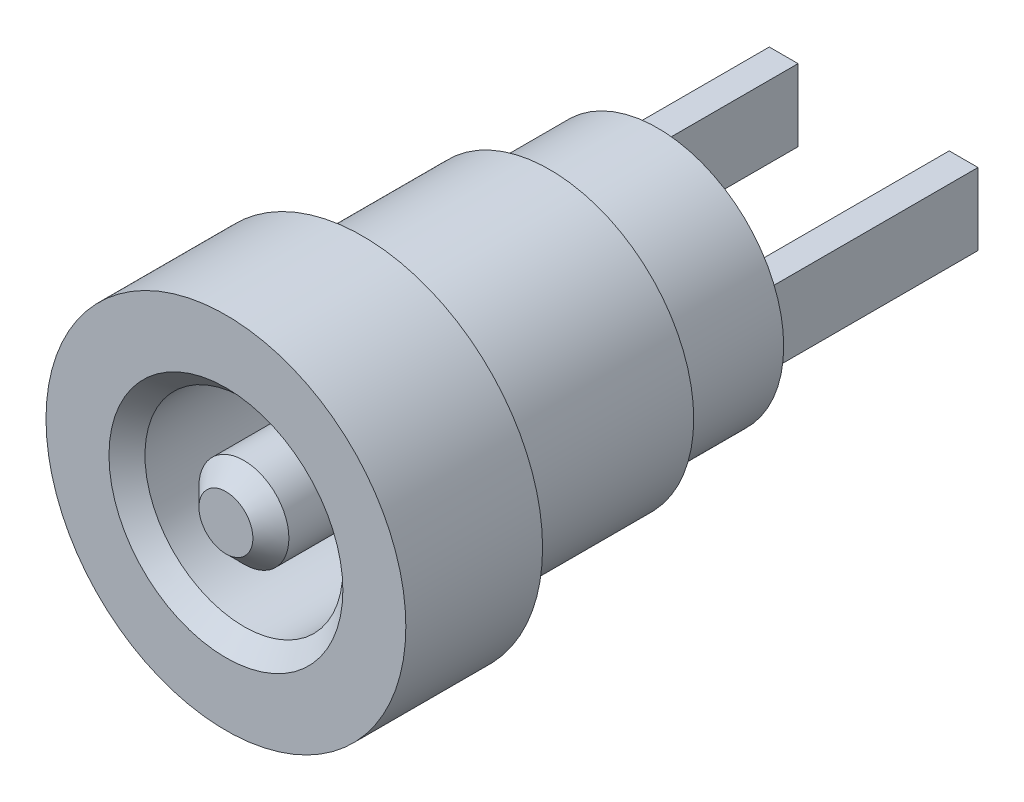
ISO-10303-21;
HEADER;
FILE_DESCRIPTION(('STEP AP214'),'2;1');
FILE_NAME('part.step','',(''),(''),'','','');
FILE_SCHEMA(('AUTOMOTIVE_DESIGN { 1 0 10303 214 1 1 1 1 }'));
ENDSEC;
DATA;
#1=APPLICATION_CONTEXT('core data for automotive mechanical design processes');
#2=APPLICATION_PROTOCOL_DEFINITION('international standard','automotive_design',2000,#1);
#3=PRODUCT_CONTEXT('',#1,'mechanical');
#4=PRODUCT('Part','Part','',(#3));
#5=PRODUCT_RELATED_PRODUCT_CATEGORY('part','',(#4));
#6=PRODUCT_DEFINITION_FORMATION('','',#4);
#7=PRODUCT_DEFINITION_CONTEXT('part definition',#1,'design');
#8=PRODUCT_DEFINITION('design','',#6,#7);
#9=PRODUCT_DEFINITION_SHAPE('','',#8);
#10=(LENGTH_UNIT() NAMED_UNIT(*) SI_UNIT(.MILLI.,.METRE.));
#11=(NAMED_UNIT(*) PLANE_ANGLE_UNIT() SI_UNIT($,.RADIAN.));
#12=(NAMED_UNIT(*) SI_UNIT($,.STERADIAN.) SOLID_ANGLE_UNIT());
#13=UNCERTAINTY_MEASURE_WITH_UNIT(LENGTH_MEASURE(1.E-05),#10,'distance_accuracy_value','');
#14=(GEOMETRIC_REPRESENTATION_CONTEXT(3) GLOBAL_UNCERTAINTY_ASSIGNED_CONTEXT((#13)) GLOBAL_UNIT_ASSIGNED_CONTEXT((#10,
#11,#12)) REPRESENTATION_CONTEXT('',''));
#15=CARTESIAN_POINT('',(0.,0.,0.));
#16=DIRECTION('',(0.,0.,1.));
#17=DIRECTION('',(1.,0.,0.));
#18=AXIS2_PLACEMENT_3D('',#15,#16,#17);
#19=CARTESIAN_POINT('',(0.,0.,12.));
#20=DIRECTION('',(0.,0.,1.));
#21=DIRECTION('',(1.,0.,0.));
#22=AXIS2_PLACEMENT_3D('',#19,#20,#21);
#23=PLANE('',#22);
#24=CARTESIAN_POINT('',(0.,0.,12.0000000000005));
#25=DIRECTION('',(0.,0.,-1.));
#26=DIRECTION('',(-1.,0.,0.));
#27=AXIS2_PLACEMENT_3D('',#24,#25,#26);
#28=CIRCLE('',#27,0.749999999982265);
#29=CARTESIAN_POINT('',(-0.749999999982265,0.,12.0000000000005));
#30=VERTEX_POINT('',#29);
#31=EDGE_CURVE('E19',#30,#30,#28,.T.);
#32=ORIENTED_EDGE('',*,*,#31,.F.);
#33=EDGE_LOOP('',(#32));
#34=FACE_BOUND('',#33,.T.);
#35=ADVANCED_FACE('F16',(#34),#23,.T.);
#36=CARTESIAN_POINT('',(0.,0.,11.4999999999554));
#37=DIRECTION('',(0.,0.,-1.));
#38=DIRECTION('',(-1.,0.,0.));
#39=AXIS2_PLACEMENT_3D('',#36,#37,#38);
#40=CONICAL_SURFACE('',#39,1.25000000002728,0.785398163397448);
#41=ORIENTED_EDGE('',*,*,#31,.T.);
#42=EDGE_LOOP('',(#41));
#43=FACE_BOUND('',#42,.T.);
#44=CARTESIAN_POINT('',(0.,0.,11.5));
#45=DIRECTION('',(0.,0.,1.));
#46=DIRECTION('',(1.,0.,0.));
#47=AXIS2_PLACEMENT_3D('',#44,#45,#46);
#48=CIRCLE('',#47,1.25);
#49=CARTESIAN_POINT('',(1.25,0.,11.5));
#50=VERTEX_POINT('',#49);
#51=EDGE_CURVE('E125',#50,#50,#48,.F.);
#52=ORIENTED_EDGE('',*,*,#51,.F.);
#53=EDGE_LOOP('',(#52));
#54=FACE_BOUND('',#53,.T.);
#55=ADVANCED_FACE('F158',(#43,#54),#40,.T.);
#56=CARTESIAN_POINT('',(0.,0.,6.));
#57=DIRECTION('',(0.,0.,1.));
#58=DIRECTION('',(1.,0.,0.));
#59=AXIS2_PLACEMENT_3D('',#56,#57,#58);
#60=CYLINDRICAL_SURFACE('',#59,1.25);
#61=CARTESIAN_POINT('',(0.,0.,6.));
#62=DIRECTION('',(0.,0.,1.));
#63=DIRECTION('',(1.,0.,0.));
#64=AXIS2_PLACEMENT_3D('',#61,#62,#63);
#65=CIRCLE('',#64,1.25);
#66=CARTESIAN_POINT('',(1.25,0.,6.));
#67=VERTEX_POINT('',#66);
#68=EDGE_CURVE('E127',#67,#67,#65,.F.);
#69=ORIENTED_EDGE('',*,*,#68,.F.);
#70=EDGE_LOOP('',(#69));
#71=FACE_BOUND('',#70,.T.);
#72=ORIENTED_EDGE('',*,*,#51,.T.);
#73=EDGE_LOOP('',(#72));
#74=FACE_BOUND('',#73,.T.);
#75=ADVANCED_FACE('F155',(#71,#74),#60,.T.);
#76=CARTESIAN_POINT('',(0.,0.,6.));
#77=DIRECTION('',(0.,0.,1.));
#78=DIRECTION('',(1.,0.,0.));
#79=AXIS2_PLACEMENT_3D('',#76,#77,#78);
#80=PLANE('',#79);
#81=CARTESIAN_POINT('',(0.,0.,6.));
#82=DIRECTION('',(0.,0.,1.));
#83=DIRECTION('',(1.,0.,0.));
#84=AXIS2_PLACEMENT_3D('',#81,#82,#83);
#85=CIRCLE('',#84,2.75);
#86=CARTESIAN_POINT('',(2.75,0.,6.));
#87=VERTEX_POINT('',#86);
#88=EDGE_CURVE('E122',#87,#87,#85,.T.);
#89=ORIENTED_EDGE('',*,*,#88,.T.);
#90=EDGE_LOOP('',(#89));
#91=FACE_BOUND('',#90,.T.);
#92=ORIENTED_EDGE('',*,*,#68,.T.);
#93=EDGE_LOOP('',(#92));
#94=FACE_BOUND('',#93,.T.);
#95=ADVANCED_FACE('F153',(#91,#94),#80,.T.);
#96=CARTESIAN_POINT('',(0.,0.,6.));
#97=DIRECTION('',(0.,0.,1.));
#98=DIRECTION('',(1.,0.,0.));
#99=AXIS2_PLACEMENT_3D('',#96,#97,#98);
#100=CYLINDRICAL_SURFACE('',#99,2.75);
#101=ORIENTED_EDGE('',*,*,#88,.F.);
#102=EDGE_LOOP('',(#101));
#103=FACE_BOUND('',#102,.T.);
#104=CARTESIAN_POINT('',(0.,0.,11.5000000000123));
#105=DIRECTION('',(0.,0.,1.));
#106=DIRECTION('',(1.,0.,0.));
#107=AXIS2_PLACEMENT_3D('',#104,#105,#106);
#108=CIRCLE('',#107,2.74999999993497);
#109=CARTESIAN_POINT('',(2.74999999993497,0.,11.5000000000123));
#110=VERTEX_POINT('',#109);
#111=EDGE_CURVE('E101',#110,#110,#108,.T.);
#112=ORIENTED_EDGE('',*,*,#111,.T.);
#113=EDGE_LOOP('',(#112));
#114=FACE_BOUND('',#113,.T.);
#115=ADVANCED_FACE('F238',(#103,#114),#100,.F.);
#116=CARTESIAN_POINT('',(2.1,-1.,-6.));
#117=DIRECTION('',(0.,1.,0.));
#118=DIRECTION('',(-1.,0.,0.));
#119=AXIS2_PLACEMENT_3D('',#116,#117,#118);
#120=PLANE('',#119);
#121=DIRECTION('',(0.,0.,1.));
#122=VECTOR('',#121,1.);
#123=CARTESIAN_POINT('',(2.1,-1.,-6.));
#124=LINE('',#123,#122);
#125=CARTESIAN_POINT('',(2.1,-1.,0.));
#126=VERTEX_POINT('',#125);
#127=CARTESIAN_POINT('',(2.1,-1.,-6.));
#128=VERTEX_POINT('',#127);
#129=EDGE_CURVE('E106',#126,#128,#124,.F.);
#130=ORIENTED_EDGE('',*,*,#129,.T.);
#131=DIRECTION('',(1.,0.,0.));
#132=VECTOR('',#131,1.);
#133=CARTESIAN_POINT('',(0.,-1.,-6.));
#134=LINE('',#133,#132);
#135=CARTESIAN_POINT('',(2.9,-1.,-6.));
#136=VERTEX_POINT('',#135);
#137=EDGE_CURVE('E77',#128,#136,#134,.T.);
#138=ORIENTED_EDGE('',*,*,#137,.T.);
#139=DIRECTION('',(0.,0.,1.));
#140=VECTOR('',#139,1.);
#141=CARTESIAN_POINT('',(2.9,-1.,-6.));
#142=LINE('',#141,#140);
#143=CARTESIAN_POINT('',(2.9,-1.,0.));
#144=VERTEX_POINT('',#143);
#145=EDGE_CURVE('E104',#136,#144,#142,.T.);
#146=ORIENTED_EDGE('',*,*,#145,.T.);
#147=DIRECTION('',(-1.,0.,0.));
#148=VECTOR('',#147,1.);
#149=CARTESIAN_POINT('',(2.1,-1.,0.));
#150=LINE('',#149,#148);
#151=EDGE_CURVE('E120',#126,#144,#150,.F.);
#152=ORIENTED_EDGE('',*,*,#151,.F.);
#153=EDGE_LOOP('',(#130,#138,#146,#152));
#154=FACE_BOUND('',#153,.T.);
#155=ADVANCED_FACE('F235',(#154),#120,.F.);
#156=CARTESIAN_POINT('',(0.,0.,-6.));
#157=DIRECTION('',(0.,0.,1.));
#158=DIRECTION('',(1.,0.,0.));
#159=AXIS2_PLACEMENT_3D('',#156,#157,#158);
#160=PLANE('',#159);
#161=DIRECTION('',(1.,0.,0.));
#162=VECTOR('',#161,1.);
#163=CARTESIAN_POINT('',(2.1,1.,-6.));
#164=LINE('',#163,#162);
#165=CARTESIAN_POINT('',(2.1,1.,-6.));
#166=VERTEX_POINT('',#165);
#167=CARTESIAN_POINT('',(2.9,1.,-6.));
#168=VERTEX_POINT('',#167);
#169=EDGE_CURVE('E82',#166,#168,#164,.T.);
#170=ORIENTED_EDGE('',*,*,#169,.T.);
#171=DIRECTION('',(0.,-1.,0.));
#172=VECTOR('',#171,1.);
#173=CARTESIAN_POINT('',(2.9,1.,-6.));
#174=LINE('',#173,#172);
#175=EDGE_CURVE('E86',#168,#136,#174,.T.);
#176=ORIENTED_EDGE('',*,*,#175,.T.);
#177=ORIENTED_EDGE('',*,*,#137,.F.);
#178=DIRECTION('',(0.,1.,0.));
#179=VECTOR('',#178,1.);
#180=CARTESIAN_POINT('',(2.1,1.,-6.));
#181=LINE('',#180,#179);
#182=EDGE_CURVE('E89',#128,#166,#181,.T.);
#183=ORIENTED_EDGE('',*,*,#182,.T.);
#184=EDGE_LOOP('',(#170,#176,#177,#183));
#185=FACE_BOUND('',#184,.T.);
#186=ADVANCED_FACE('F84',(#185),#160,.F.);
#187=CARTESIAN_POINT('',(2.1,1.,-6.));
#188=DIRECTION('',(0.,-1.,0.));
#189=DIRECTION('',(1.,0.,0.));
#190=AXIS2_PLACEMENT_3D('',#187,#188,#189);
#191=PLANE('',#190);
#192=DIRECTION('',(0.,0.,1.));
#193=VECTOR('',#192,1.);
#194=CARTESIAN_POINT('',(2.9,1.,-6.));
#195=LINE('',#194,#193);
#196=CARTESIAN_POINT('',(2.9,1.,0.));
#197=VERTEX_POINT('',#196);
#198=EDGE_CURVE('E96',#197,#168,#195,.F.);
#199=ORIENTED_EDGE('',*,*,#198,.T.);
#200=ORIENTED_EDGE('',*,*,#169,.F.);
#201=DIRECTION('',(0.,0.,1.));
#202=VECTOR('',#201,1.);
#203=CARTESIAN_POINT('',(2.1,1.,-6.));
#204=LINE('',#203,#202);
#205=CARTESIAN_POINT('',(2.1,1.,0.));
#206=VERTEX_POINT('',#205);
#207=EDGE_CURVE('E394',#166,#206,#204,.T.);
#208=ORIENTED_EDGE('',*,*,#207,.T.);
#209=DIRECTION('',(1.,0.,0.));
#210=VECTOR('',#209,1.);
#211=CARTESIAN_POINT('',(2.1,1.,0.));
#212=LINE('',#211,#210);
#213=EDGE_CURVE('E93',#197,#206,#212,.F.);
#214=ORIENTED_EDGE('',*,*,#213,.F.);
#215=EDGE_LOOP('',(#199,#200,#208,#214));
#216=FACE_BOUND('',#215,.T.);
#217=ADVANCED_FACE('F97',(#216),#191,.F.);
#218=CARTESIAN_POINT('',(-2.1,1.,-6.));
#219=DIRECTION('',(0.,-1.,0.));
#220=DIRECTION('',(1.,0.,0.));
#221=AXIS2_PLACEMENT_3D('',#218,#219,#220);
#222=PLANE('',#221);
#223=DIRECTION('',(0.,0.,1.));
#224=VECTOR('',#223,1.);
#225=CARTESIAN_POINT('',(-2.1,1.,-6.));
#226=LINE('',#225,#224);
#227=CARTESIAN_POINT('',(-2.1,1.,0.));
#228=VERTEX_POINT('',#227);
#229=CARTESIAN_POINT('',(-2.1,1.,-6.));
#230=VERTEX_POINT('',#229);
#231=EDGE_CURVE('E406',#228,#230,#226,.F.);
#232=ORIENTED_EDGE('',*,*,#231,.T.);
#233=DIRECTION('',(-1.,0.,0.));
#234=VECTOR('',#233,1.);
#235=CARTESIAN_POINT('',(0.,1.,-6.));
#236=LINE('',#235,#234);
#237=CARTESIAN_POINT('',(-2.9,1.,-6.));
#238=VERTEX_POINT('',#237);
#239=EDGE_CURVE('E114',#238,#230,#236,.F.);
#240=ORIENTED_EDGE('',*,*,#239,.F.);
#241=DIRECTION('',(0.,0.,1.));
#242=VECTOR('',#241,1.);
#243=CARTESIAN_POINT('',(-2.9,1.,-6.));
#244=LINE('',#243,#242);
#245=CARTESIAN_POINT('',(-2.9,1.,0.));
#246=VERTEX_POINT('',#245);
#247=EDGE_CURVE('E404',#238,#246,#244,.T.);
#248=ORIENTED_EDGE('',*,*,#247,.T.);
#249=DIRECTION('',(1.,0.,0.));
#250=VECTOR('',#249,1.);
#251=CARTESIAN_POINT('',(-2.1,1.,0.));
#252=LINE('',#251,#250);
#253=EDGE_CURVE('E34',#228,#246,#252,.F.);
#254=ORIENTED_EDGE('',*,*,#253,.F.);
#255=EDGE_LOOP('',(#232,#240,#248,#254));
#256=FACE_BOUND('',#255,.T.);
#257=ADVANCED_FACE('F227',(#256),#222,.F.);
#258=CARTESIAN_POINT('',(0.,0.,-6.));
#259=DIRECTION('',(0.,0.,-1.));
#260=DIRECTION('',(-1.,0.,0.));
#261=AXIS2_PLACEMENT_3D('',#258,#259,#260);
#262=PLANE('',#261);
#263=DIRECTION('',(0.,1.,0.));
#264=VECTOR('',#263,1.);
#265=CARTESIAN_POINT('',(-2.9,1.,-6.));
#266=LINE('',#265,#264);
#267=CARTESIAN_POINT('',(-2.9,-1.,-6.));
#268=VERTEX_POINT('',#267);
#269=EDGE_CURVE('E401',#268,#238,#266,.T.);
#270=ORIENTED_EDGE('',*,*,#269,.T.);
#271=ORIENTED_EDGE('',*,*,#239,.T.);
#272=DIRECTION('',(0.,-1.,0.));
#273=VECTOR('',#272,1.);
#274=CARTESIAN_POINT('',(-2.1,1.,-6.));
#275=LINE('',#274,#273);
#276=CARTESIAN_POINT('',(-2.1,-1.,-6.));
#277=VERTEX_POINT('',#276);
#278=EDGE_CURVE('E408',#230,#277,#275,.T.);
#279=ORIENTED_EDGE('',*,*,#278,.T.);
#280=DIRECTION('',(-1.,0.,0.));
#281=VECTOR('',#280,1.);
#282=CARTESIAN_POINT('',(-2.1,-1.,-6.));
#283=LINE('',#282,#281);
#284=EDGE_CURVE('E112',#277,#268,#283,.T.);
#285=ORIENTED_EDGE('',*,*,#284,.T.);
#286=EDGE_LOOP('',(#270,#271,#279,#285));
#287=FACE_BOUND('',#286,.T.);
#288=ADVANCED_FACE('F223',(#287),#262,.T.);
#289=CARTESIAN_POINT('',(-2.1,-1.,-6.));
#290=DIRECTION('',(0.,1.,0.));
#291=DIRECTION('',(-1.,0.,0.));
#292=AXIS2_PLACEMENT_3D('',#289,#290,#291);
#293=PLANE('',#292);
#294=DIRECTION('',(0.,0.,1.));
#295=VECTOR('',#294,1.);
#296=CARTESIAN_POINT('',(-2.9,-1.,-6.));
#297=LINE('',#296,#295);
#298=CARTESIAN_POINT('',(-2.9,-1.,0.));
#299=VERTEX_POINT('',#298);
#300=EDGE_CURVE('E396',#299,#268,#297,.F.);
#301=ORIENTED_EDGE('',*,*,#300,.T.);
#302=ORIENTED_EDGE('',*,*,#284,.F.);
#303=DIRECTION('',(0.,0.,1.));
#304=VECTOR('',#303,1.);
#305=CARTESIAN_POINT('',(-2.1,-1.,-6.));
#306=LINE('',#305,#304);
#307=CARTESIAN_POINT('',(-2.1,-1.,0.));
#308=VERTEX_POINT('',#307);
#309=EDGE_CURVE('E148',#277,#308,#306,.T.);
#310=ORIENTED_EDGE('',*,*,#309,.T.);
#311=DIRECTION('',(-1.,0.,0.));
#312=VECTOR('',#311,1.);
#313=CARTESIAN_POINT('',(-2.1,-1.,0.));
#314=LINE('',#313,#312);
#315=EDGE_CURVE('E110',#299,#308,#314,.F.);
#316=ORIENTED_EDGE('',*,*,#315,.F.);
#317=EDGE_LOOP('',(#301,#302,#310,#316));
#318=FACE_BOUND('',#317,.T.);
#319=ADVANCED_FACE('F219',(#318),#293,.F.);
#320=CARTESIAN_POINT('',(0.,0.,12.0000000000005));
#321=DIRECTION('',(0.,0.,1.));
#322=DIRECTION('',(0.,-1.,0.));
#323=AXIS2_PLACEMENT_3D('',#320,#321,#322);
#324=CONICAL_SURFACE('',#323,3.24999999997999,0.785398163454292);
#325=ORIENTED_EDGE('',*,*,#111,.F.);
#326=EDGE_LOOP('',(#325));
#327=FACE_BOUND('',#326,.T.);
#328=CARTESIAN_POINT('',(0.,0.,12.0000000000005));
#329=DIRECTION('',(0.,0.,1.));
#330=DIRECTION('',(0.,-1.,0.));
#331=AXIS2_PLACEMENT_3D('',#328,#329,#330);
#332=CIRCLE('',#331,3.24999999997999);
#333=CARTESIAN_POINT('',(0.,-3.24999999997999,12.0000000000005));
#334=VERTEX_POINT('',#333);
#335=EDGE_CURVE('E144',#334,#334,#332,.F.);
#336=ORIENTED_EDGE('',*,*,#335,.F.);
#337=EDGE_LOOP('',(#336));
#338=FACE_BOUND('',#337,.T.);
#339=ADVANCED_FACE('F216',(#327,#338),#324,.F.);
#340=CARTESIAN_POINT('',(2.9,1.,-6.));
#341=DIRECTION('',(-1.,0.,0.));
#342=DIRECTION('',(0.,-1.,0.));
#343=AXIS2_PLACEMENT_3D('',#340,#341,#342);
#344=PLANE('',#343);
#345=ORIENTED_EDGE('',*,*,#145,.F.);
#346=ORIENTED_EDGE('',*,*,#175,.F.);
#347=ORIENTED_EDGE('',*,*,#198,.F.);
#348=DIRECTION('',(0.,1.,0.));
#349=VECTOR('',#348,1.);
#350=CARTESIAN_POINT('',(2.9,0.,0.));
#351=LINE('',#350,#349);
#352=EDGE_CURVE('E147',#197,#144,#351,.F.);
#353=ORIENTED_EDGE('',*,*,#352,.T.);
#354=EDGE_LOOP('',(#345,#346,#347,#353));
#355=FACE_BOUND('',#354,.T.);
#356=ADVANCED_FACE('F103',(#355),#344,.F.);
#357=CARTESIAN_POINT('',(2.1,1.,-6.));
#358=DIRECTION('',(1.,0.,0.));
#359=DIRECTION('',(0.,1.,0.));
#360=AXIS2_PLACEMENT_3D('',#357,#358,#359);
#361=PLANE('',#360);
#362=ORIENTED_EDGE('',*,*,#207,.F.);
#363=ORIENTED_EDGE('',*,*,#182,.F.);
#364=ORIENTED_EDGE('',*,*,#129,.F.);
#365=DIRECTION('',(0.,1.,0.));
#366=VECTOR('',#365,1.);
#367=CARTESIAN_POINT('',(2.1,0.,0.));
#368=LINE('',#367,#366);
#369=EDGE_CURVE('E413',#126,#206,#368,.T.);
#370=ORIENTED_EDGE('',*,*,#369,.T.);
#371=EDGE_LOOP('',(#362,#363,#364,#370));
#372=FACE_BOUND('',#371,.T.);
#373=ADVANCED_FACE('F209',(#372),#361,.F.);
#374=CARTESIAN_POINT('',(-2.9,1.,-6.));
#375=DIRECTION('',(1.,0.,0.));
#376=DIRECTION('',(0.,1.,0.));
#377=AXIS2_PLACEMENT_3D('',#374,#375,#376);
#378=PLANE('',#377);
#379=ORIENTED_EDGE('',*,*,#247,.F.);
#380=ORIENTED_EDGE('',*,*,#269,.F.);
#381=ORIENTED_EDGE('',*,*,#300,.F.);
#382=DIRECTION('',(0.,1.,0.));
#383=VECTOR('',#382,1.);
#384=CARTESIAN_POINT('',(-2.9,0.,0.));
#385=LINE('',#384,#383);
#386=EDGE_CURVE('E415',#299,#246,#385,.T.);
#387=ORIENTED_EDGE('',*,*,#386,.T.);
#388=EDGE_LOOP('',(#379,#380,#381,#387));
#389=FACE_BOUND('',#388,.T.);
#390=ADVANCED_FACE('F205',(#389),#378,.F.);
#391=CARTESIAN_POINT('',(-2.1,1.,-6.));
#392=DIRECTION('',(-1.,0.,0.));
#393=DIRECTION('',(0.,-1.,0.));
#394=AXIS2_PLACEMENT_3D('',#391,#392,#393);
#395=PLANE('',#394);
#396=ORIENTED_EDGE('',*,*,#309,.F.);
#397=ORIENTED_EDGE('',*,*,#278,.F.);
#398=ORIENTED_EDGE('',*,*,#231,.F.);
#399=DIRECTION('',(0.,1.,0.));
#400=VECTOR('',#399,1.);
#401=CARTESIAN_POINT('',(-2.1,0.,0.));
#402=LINE('',#401,#400);
#403=EDGE_CURVE('E143',#228,#308,#402,.F.);
#404=ORIENTED_EDGE('',*,*,#403,.T.);
#405=EDGE_LOOP('',(#396,#397,#398,#404));
#406=FACE_BOUND('',#405,.T.);
#407=ADVANCED_FACE('F201',(#406),#395,.F.);
#408=CARTESIAN_POINT('',(0.,0.,12.));
#409=DIRECTION('',(0.,0.,1.));
#410=DIRECTION('',(1.,0.,0.));
#411=AXIS2_PLACEMENT_3D('',#408,#409,#410);
#412=PLANE('',#411);
#413=CARTESIAN_POINT('',(0.,0.,12.));
#414=DIRECTION('',(0.,0.,-1.));
#415=DIRECTION('',(-1.,0.,0.));
#416=AXIS2_PLACEMENT_3D('',#413,#414,#415);
#417=CIRCLE('',#416,5.);
#418=CARTESIAN_POINT('',(-5.,0.,12.));
#419=VERTEX_POINT('',#418);
#420=EDGE_CURVE('E140',#419,#419,#417,.T.);
#421=ORIENTED_EDGE('',*,*,#420,.F.);
#422=EDGE_LOOP('',(#421));
#423=FACE_BOUND('',#422,.T.);
#424=ORIENTED_EDGE('',*,*,#335,.T.);
#425=EDGE_LOOP('',(#424));
#426=FACE_BOUND('',#425,.T.);
#427=ADVANCED_FACE('F197',(#423,#426),#412,.T.);
#428=CARTESIAN_POINT('',(0.,0.,0.));
#429=DIRECTION('',(0.,0.,1.));
#430=DIRECTION('',(1.,0.,0.));
#431=AXIS2_PLACEMENT_3D('',#428,#429,#430);
#432=PLANE('',#431);
#433=ORIENTED_EDGE('',*,*,#253,.T.);
#434=ORIENTED_EDGE('',*,*,#386,.F.);
#435=ORIENTED_EDGE('',*,*,#315,.T.);
#436=ORIENTED_EDGE('',*,*,#403,.F.);
#437=EDGE_LOOP('',(#433,#434,#435,#436));
#438=FACE_BOUND('',#437,.T.);
#439=CARTESIAN_POINT('',(0.,0.,0.));
#440=DIRECTION('',(0.,0.,-1.));
#441=DIRECTION('',(-1.,0.,0.));
#442=AXIS2_PLACEMENT_3D('',#439,#440,#441);
#443=CIRCLE('',#442,3.5);
#444=CARTESIAN_POINT('',(-3.5,0.,0.));
#445=VERTEX_POINT('',#444);
#446=EDGE_CURVE('E137',#445,#445,#443,.F.);
#447=ORIENTED_EDGE('',*,*,#446,.F.);
#448=EDGE_LOOP('',(#447));
#449=FACE_BOUND('',#448,.T.);
#450=ORIENTED_EDGE('',*,*,#151,.T.);
#451=ORIENTED_EDGE('',*,*,#352,.F.);
#452=ORIENTED_EDGE('',*,*,#213,.T.);
#453=ORIENTED_EDGE('',*,*,#369,.F.);
#454=EDGE_LOOP('',(#450,#451,#452,#453));
#455=FACE_BOUND('',#454,.T.);
#456=ADVANCED_FACE('F193',(#438,#449,#455),#432,.F.);
#457=CARTESIAN_POINT('',(0.,0.,12.));
#458=DIRECTION('',(0.,0.,-1.));
#459=DIRECTION('',(-1.,0.,0.));
#460=AXIS2_PLACEMENT_3D('',#457,#458,#459);
#461=CYLINDRICAL_SURFACE('',#460,5.);
#462=ORIENTED_EDGE('',*,*,#420,.T.);
#463=EDGE_LOOP('',(#462));
#464=FACE_BOUND('',#463,.T.);
#465=CARTESIAN_POINT('',(0.,0.,8.2));
#466=DIRECTION('',(0.,0.,-1.));
#467=DIRECTION('',(-1.,0.,0.));
#468=AXIS2_PLACEMENT_3D('',#465,#466,#467);
#469=CIRCLE('',#468,5.);
#470=CARTESIAN_POINT('',(-5.,0.,8.2));
#471=VERTEX_POINT('',#470);
#472=EDGE_CURVE('E134',#471,#471,#469,.F.);
#473=ORIENTED_EDGE('',*,*,#472,.T.);
#474=EDGE_LOOP('',(#473));
#475=FACE_BOUND('',#474,.T.);
#476=ADVANCED_FACE('F189',(#464,#475),#461,.T.);
#477=CARTESIAN_POINT('',(0.,0.,3.));
#478=DIRECTION('',(0.,0.,-1.));
#479=DIRECTION('',(-1.,0.,0.));
#480=AXIS2_PLACEMENT_3D('',#477,#478,#479);
#481=CYLINDRICAL_SURFACE('',#480,3.5);
#482=CARTESIAN_POINT('',(0.,0.,3.));
#483=DIRECTION('',(0.,0.,-1.));
#484=DIRECTION('',(-1.,0.,0.));
#485=AXIS2_PLACEMENT_3D('',#482,#483,#484);
#486=CIRCLE('',#485,3.5);
#487=CARTESIAN_POINT('',(-3.5,0.,3.));
#488=VERTEX_POINT('',#487);
#489=EDGE_CURVE('E131',#488,#488,#486,.T.);
#490=ORIENTED_EDGE('',*,*,#489,.T.);
#491=EDGE_LOOP('',(#490));
#492=FACE_BOUND('',#491,.T.);
#493=ORIENTED_EDGE('',*,*,#446,.T.);
#494=EDGE_LOOP('',(#493));
#495=FACE_BOUND('',#494,.T.);
#496=ADVANCED_FACE('F185',(#492,#495),#481,.T.);
#497=CARTESIAN_POINT('',(0.,0.,8.2));
#498=DIRECTION('',(0.,0.,1.));
#499=DIRECTION('',(1.,0.,0.));
#500=AXIS2_PLACEMENT_3D('',#497,#498,#499);
#501=PLANE('',#500);
#502=ORIENTED_EDGE('',*,*,#472,.F.);
#503=EDGE_LOOP('',(#502));
#504=FACE_BOUND('',#503,.T.);
#505=CARTESIAN_POINT('',(0.,0.,8.2));
#506=DIRECTION('',(0.,0.,-1.));
#507=DIRECTION('',(-1.,0.,0.));
#508=AXIS2_PLACEMENT_3D('',#505,#506,#507);
#509=CIRCLE('',#508,4.);
#510=CARTESIAN_POINT('',(-4.,0.,8.2));
#511=VERTEX_POINT('',#510);
#512=EDGE_CURVE('E25',#511,#511,#509,.T.);
#513=ORIENTED_EDGE('',*,*,#512,.F.);
#514=EDGE_LOOP('',(#513));
#515=FACE_BOUND('',#514,.T.);
#516=ADVANCED_FACE('F178',(#504,#515),#501,.F.);
#517=CARTESIAN_POINT('',(0.,0.,3.));
#518=DIRECTION('',(0.,0.,1.));
#519=DIRECTION('',(1.,0.,0.));
#520=AXIS2_PLACEMENT_3D('',#517,#518,#519);
#521=PLANE('',#520);
#522=CARTESIAN_POINT('',(0.,0.,3.));
#523=DIRECTION('',(0.,0.,-1.));
#524=DIRECTION('',(-1.,0.,0.));
#525=AXIS2_PLACEMENT_3D('',#522,#523,#524);
#526=CIRCLE('',#525,4.);
#527=CARTESIAN_POINT('',(-4.,0.,3.));
#528=VERTEX_POINT('',#527);
#529=EDGE_CURVE('E11',#528,#528,#526,.F.);
#530=ORIENTED_EDGE('',*,*,#529,.F.);
#531=EDGE_LOOP('',(#530));
#532=FACE_BOUND('',#531,.T.);
#533=ORIENTED_EDGE('',*,*,#489,.F.);
#534=EDGE_LOOP('',(#533));
#535=FACE_BOUND('',#534,.T.);
#536=ADVANCED_FACE('F172',(#532,#535),#521,.F.);
#537=CARTESIAN_POINT('',(0.,0.,8.2));
#538=DIRECTION('',(0.,0.,-1.));
#539=DIRECTION('',(-1.,0.,0.));
#540=AXIS2_PLACEMENT_3D('',#537,#538,#539);
#541=CYLINDRICAL_SURFACE('',#540,4.);
#542=ORIENTED_EDGE('',*,*,#529,.T.);
#543=EDGE_LOOP('',(#542));
#544=FACE_BOUND('',#543,.T.);
#545=ORIENTED_EDGE('',*,*,#512,.T.);
#546=EDGE_LOOP('',(#545));
#547=FACE_BOUND('',#546,.T.);
#548=ADVANCED_FACE('F170',(#544,#547),#541,.T.);
#549=CLOSED_SHELL('',(#35,#55,#75,#95,#115,#155,#186,#217,#257,#288,#319,#339,#356,#373,#390,
#407,#427,#456,#476,#496,#516,#536,#548));
#550=MANIFOLD_SOLID_BREP('B1',#549);
#551=ADVANCED_BREP_SHAPE_REPRESENTATION('',(#18,#550),#14);
#552=SHAPE_DEFINITION_REPRESENTATION(#9,#551);
ENDSEC;
END-ISO-10303-21;
